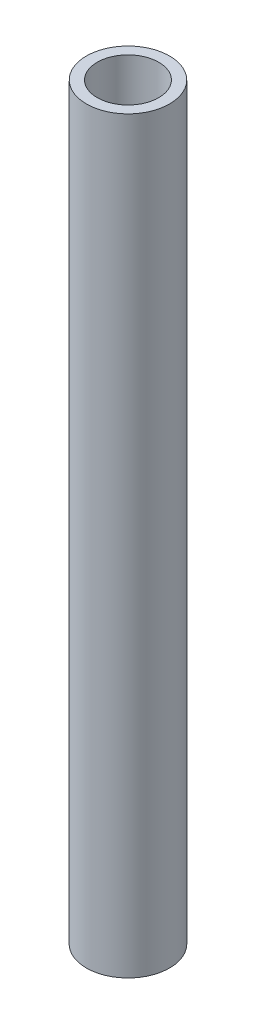
ISO-10303-21;
HEADER;
FILE_DESCRIPTION(('STEP AP214'),'2;1');
FILE_NAME('part.step','',(''),(''),'','','');
FILE_SCHEMA(('AUTOMOTIVE_DESIGN { 1 0 10303 214 1 1 1 1 }'));
ENDSEC;
DATA;
#1=APPLICATION_CONTEXT('core data for automotive mechanical design processes');
#2=APPLICATION_PROTOCOL_DEFINITION('international standard','automotive_design',2000,#1);
#3=PRODUCT_CONTEXT('',#1,'mechanical');
#4=PRODUCT('Part','Part','',(#3));
#5=PRODUCT_RELATED_PRODUCT_CATEGORY('part','',(#4));
#6=PRODUCT_DEFINITION_FORMATION('','',#4);
#7=PRODUCT_DEFINITION_CONTEXT('part definition',#1,'design');
#8=PRODUCT_DEFINITION('design','',#6,#7);
#9=PRODUCT_DEFINITION_SHAPE('','',#8);
#10=(LENGTH_UNIT() NAMED_UNIT(*) SI_UNIT(.MILLI.,.METRE.));
#11=(NAMED_UNIT(*) PLANE_ANGLE_UNIT() SI_UNIT($,.RADIAN.));
#12=(NAMED_UNIT(*) SI_UNIT($,.STERADIAN.) SOLID_ANGLE_UNIT());
#13=UNCERTAINTY_MEASURE_WITH_UNIT(LENGTH_MEASURE(1.E-05),#10,'distance_accuracy_value','');
#14=(GEOMETRIC_REPRESENTATION_CONTEXT(3) GLOBAL_UNCERTAINTY_ASSIGNED_CONTEXT((#13)) GLOBAL_UNIT_ASSIGNED_CONTEXT((#10,
#11,#12)) REPRESENTATION_CONTEXT('',''));
#15=CARTESIAN_POINT('',(0.,0.,0.));
#16=DIRECTION('',(0.,0.,1.));
#17=DIRECTION('',(1.,0.,0.));
#18=AXIS2_PLACEMENT_3D('',#15,#16,#17);
#19=CARTESIAN_POINT('',(0.,342.9,0.));
#20=DIRECTION('',(0.,-1.,0.));
#21=DIRECTION('',(0.,0.,-1.));
#22=AXIS2_PLACEMENT_3D('',#19,#20,#21);
#23=CYLINDRICAL_SURFACE('',#22,19.05);
#24=CARTESIAN_POINT('',(0.,342.9,0.));
#25=DIRECTION('',(0.,1.,0.));
#26=DIRECTION('',(0.,0.,1.));
#27=AXIS2_PLACEMENT_3D('',#24,#25,#26);
#28=CIRCLE('',#27,19.05);
#29=CARTESIAN_POINT('',(0.,342.9,19.05));
#30=VERTEX_POINT('',#29);
#31=EDGE_CURVE('E10',#30,#30,#28,.T.);
#32=ORIENTED_EDGE('',*,*,#31,.F.);
#33=EDGE_LOOP('',(#32));
#34=FACE_BOUND('',#33,.T.);
#35=CARTESIAN_POINT('',(0.,0.,0.));
#36=DIRECTION('',(0.,1.,0.));
#37=DIRECTION('',(0.,0.,1.));
#38=AXIS2_PLACEMENT_3D('',#35,#36,#37);
#39=CIRCLE('',#38,19.05);
#40=CARTESIAN_POINT('',(0.,0.,19.05));
#41=VERTEX_POINT('',#40);
#42=EDGE_CURVE('E41',#41,#41,#39,.T.);
#43=ORIENTED_EDGE('',*,*,#42,.T.);
#44=EDGE_LOOP('',(#43));
#45=FACE_BOUND('',#44,.T.);
#46=ADVANCED_FACE('F34',(#34,#45),#23,.T.);
#47=CARTESIAN_POINT('',(0.,342.9,0.));
#48=DIRECTION('',(0.,1.,0.));
#49=DIRECTION('',(0.,0.,1.));
#50=AXIS2_PLACEMENT_3D('',#47,#48,#49);
#51=PLANE('',#50);
#52=CARTESIAN_POINT('',(0.,342.9,0.));
#53=DIRECTION('',(0.,1.,0.));
#54=DIRECTION('',(0.,0.,1.));
#55=AXIS2_PLACEMENT_3D('',#52,#53,#54);
#56=CIRCLE('',#55,14.08938);
#57=CARTESIAN_POINT('',(0.,342.9,14.08938));
#58=VERTEX_POINT('',#57);
#59=EDGE_CURVE('E55',#58,#58,#56,.T.);
#60=ORIENTED_EDGE('',*,*,#59,.F.);
#61=EDGE_LOOP('',(#60));
#62=FACE_BOUND('',#61,.T.);
#63=ORIENTED_EDGE('',*,*,#31,.T.);
#64=EDGE_LOOP('',(#63));
#65=FACE_BOUND('',#64,.T.);
#66=ADVANCED_FACE('F76',(#62,#65),#51,.T.);
#67=CARTESIAN_POINT('',(0.,0.,0.));
#68=DIRECTION('',(0.,1.,0.));
#69=DIRECTION('',(0.,0.,1.));
#70=AXIS2_PLACEMENT_3D('',#67,#68,#69);
#71=PLANE('',#70);
#72=CARTESIAN_POINT('',(0.,0.,0.));
#73=DIRECTION('',(0.,-1.,0.));
#74=DIRECTION('',(0.,0.,-1.));
#75=AXIS2_PLACEMENT_3D('',#72,#73,#74);
#76=CIRCLE('',#75,14.08938);
#77=CARTESIAN_POINT('',(0.,0.,-14.08938));
#78=VERTEX_POINT('',#77);
#79=EDGE_CURVE('E66',#78,#78,#76,.T.);
#80=ORIENTED_EDGE('',*,*,#79,.F.);
#81=EDGE_LOOP('',(#80));
#82=FACE_BOUND('',#81,.T.);
#83=ORIENTED_EDGE('',*,*,#42,.F.);
#84=EDGE_LOOP('',(#83));
#85=FACE_BOUND('',#84,.T.);
#86=ADVANCED_FACE('F72',(#82,#85),#71,.F.);
#87=CARTESIAN_POINT('',(0.,0.,0.));
#88=DIRECTION('',(0.,1.,0.));
#89=DIRECTION('',(0.,0.,1.));
#90=AXIS2_PLACEMENT_3D('',#87,#88,#89);
#91=CYLINDRICAL_SURFACE('',#90,12.7);
#92=CARTESIAN_POINT('',(0.,49.8568237268645,0.));
#93=DIRECTION('',(0.,-1.,0.));
#94=DIRECTION('',(0.,0.,-1.));
#95=AXIS2_PLACEMENT_3D('',#92,#93,#94);
#96=CIRCLE('',#95,12.7);
#97=CARTESIAN_POINT('',(0.,49.8568237268645,-12.7));
#98=VERTEX_POINT('',#97);
#99=EDGE_CURVE('E37',#98,#98,#96,.T.);
#100=ORIENTED_EDGE('',*,*,#99,.T.);
#101=EDGE_LOOP('',(#100));
#102=FACE_BOUND('',#101,.T.);
#103=CARTESIAN_POINT('',(0.,293.043176273135,0.));
#104=DIRECTION('',(0.,1.,0.));
#105=DIRECTION('',(0.,0.,1.));
#106=AXIS2_PLACEMENT_3D('',#103,#104,#105);
#107=CIRCLE('',#106,12.7);
#108=CARTESIAN_POINT('',(0.,293.043176273135,12.7));
#109=VERTEX_POINT('',#108);
#110=EDGE_CURVE('E46',#109,#109,#107,.T.);
#111=ORIENTED_EDGE('',*,*,#110,.T.);
#112=EDGE_LOOP('',(#111));
#113=FACE_BOUND('',#112,.T.);
#114=ADVANCED_FACE('F75',(#102,#113),#91,.F.);
#115=CARTESIAN_POINT('',(0.,293.878,0.));
#116=DIRECTION('',(0.,1.,0.));
#117=DIRECTION('',(0.,0.,1.));
#118=AXIS2_PLACEMENT_3D('',#115,#116,#117);
#119=CONICAL_SURFACE('',#118,14.08938,1.02974425867665);
#120=CARTESIAN_POINT('',(0.,293.878,0.));
#121=DIRECTION('',(0.,1.,0.));
#122=DIRECTION('',(0.,0.,1.));
#123=AXIS2_PLACEMENT_3D('',#120,#121,#122);
#124=CIRCLE('',#123,14.08938);
#125=CARTESIAN_POINT('',(0.,293.878,14.08938));
#126=VERTEX_POINT('',#125);
#127=EDGE_CURVE('E49',#126,#126,#124,.T.);
#128=ORIENTED_EDGE('',*,*,#127,.T.);
#129=EDGE_LOOP('',(#128));
#130=FACE_BOUND('',#129,.T.);
#131=ORIENTED_EDGE('',*,*,#110,.F.);
#132=EDGE_LOOP('',(#131));
#133=FACE_BOUND('',#132,.T.);
#134=ADVANCED_FACE('F91',(#130,#133),#119,.F.);
#135=CARTESIAN_POINT('',(0.,342.9,0.));
#136=DIRECTION('',(0.,1.,0.));
#137=DIRECTION('',(0.,0.,1.));
#138=AXIS2_PLACEMENT_3D('',#135,#136,#137);
#139=CYLINDRICAL_SURFACE('',#138,14.08938);
#140=ORIENTED_EDGE('',*,*,#127,.F.);
#141=EDGE_LOOP('',(#140));
#142=FACE_BOUND('',#141,.T.);
#143=ORIENTED_EDGE('',*,*,#59,.T.);
#144=EDGE_LOOP('',(#143));
#145=FACE_BOUND('',#144,.T.);
#146=ADVANCED_FACE('F95',(#142,#145),#139,.F.);
#147=CARTESIAN_POINT('',(0.,49.022,0.));
#148=DIRECTION('',(0.,-1.,0.));
#149=DIRECTION('',(0.,0.,-1.));
#150=AXIS2_PLACEMENT_3D('',#147,#148,#149);
#151=CONICAL_SURFACE('',#150,14.08938,1.02974425867665);
#152=CARTESIAN_POINT('',(0.,49.022,0.));
#153=DIRECTION('',(0.,-1.,0.));
#154=DIRECTION('',(0.,0.,-1.));
#155=AXIS2_PLACEMENT_3D('',#152,#153,#154);
#156=CIRCLE('',#155,14.08938);
#157=CARTESIAN_POINT('',(0.,49.022,-14.08938));
#158=VERTEX_POINT('',#157);
#159=EDGE_CURVE('E62',#158,#158,#156,.T.);
#160=ORIENTED_EDGE('',*,*,#159,.T.);
#161=EDGE_LOOP('',(#160));
#162=FACE_BOUND('',#161,.T.);
#163=ORIENTED_EDGE('',*,*,#99,.F.);
#164=EDGE_LOOP('',(#163));
#165=FACE_BOUND('',#164,.T.);
#166=ADVANCED_FACE('F98',(#162,#165),#151,.F.);
#167=CARTESIAN_POINT('',(0.,0.,0.));
#168=DIRECTION('',(0.,-1.,0.));
#169=DIRECTION('',(0.,0.,-1.));
#170=AXIS2_PLACEMENT_3D('',#167,#168,#169);
#171=CYLINDRICAL_SURFACE('',#170,14.08938);
#172=ORIENTED_EDGE('',*,*,#159,.F.);
#173=EDGE_LOOP('',(#172));
#174=FACE_BOUND('',#173,.T.);
#175=ORIENTED_EDGE('',*,*,#79,.T.);
#176=EDGE_LOOP('',(#175));
#177=FACE_BOUND('',#176,.T.);
#178=ADVANCED_FACE('F70',(#174,#177),#171,.F.);
#179=CLOSED_SHELL('',(#46,#66,#86,#114,#134,#146,#166,#178));
#180=MANIFOLD_SOLID_BREP('B2',#179);
#181=ADVANCED_BREP_SHAPE_REPRESENTATION('',(#18,#180),#14);
#182=SHAPE_DEFINITION_REPRESENTATION(#9,#181);
ENDSEC;
END-ISO-10303-21;
